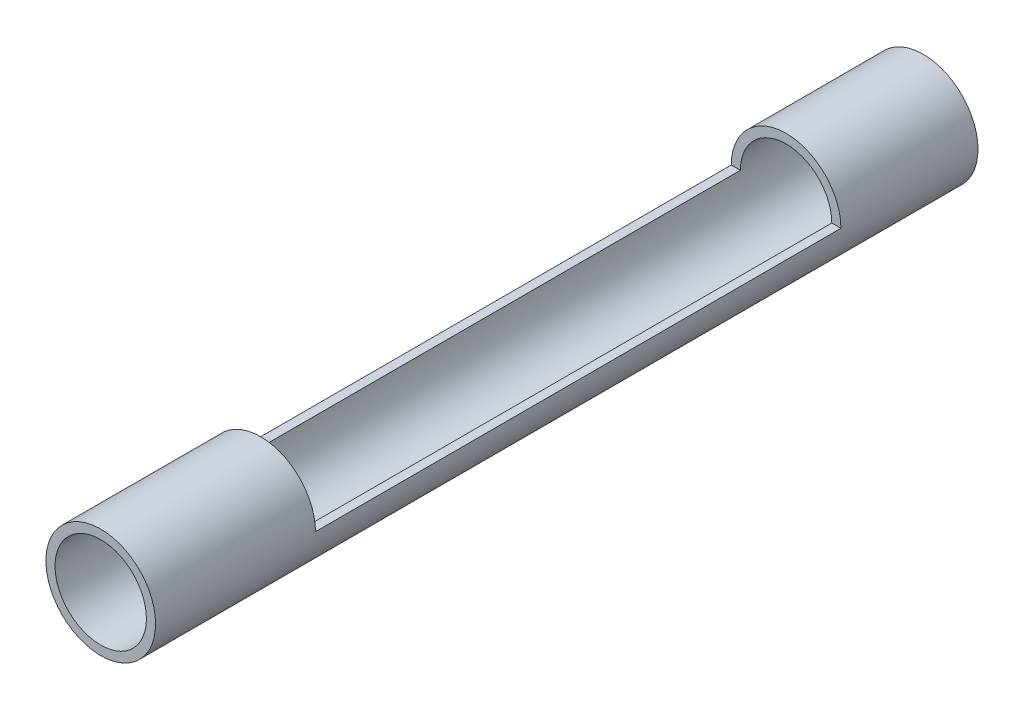
ISO-10303-21;
HEADER;
FILE_DESCRIPTION(('STEP AP214'),'2;1');
FILE_NAME('part.step','',(''),(''),'','','');
FILE_SCHEMA(('AUTOMOTIVE_DESIGN { 1 0 10303 214 1 1 1 1 }'));
ENDSEC;
DATA;
#1=APPLICATION_CONTEXT('core data for automotive mechanical design processes');
#2=APPLICATION_PROTOCOL_DEFINITION('international standard','automotive_design',2000,#1);
#3=PRODUCT_CONTEXT('',#1,'mechanical');
#4=PRODUCT('Part','Part','',(#3));
#5=PRODUCT_RELATED_PRODUCT_CATEGORY('part','',(#4));
#6=PRODUCT_DEFINITION_FORMATION('','',#4);
#7=PRODUCT_DEFINITION_CONTEXT('part definition',#1,'design');
#8=PRODUCT_DEFINITION('design','',#6,#7);
#9=PRODUCT_DEFINITION_SHAPE('','',#8);
#10=(LENGTH_UNIT() NAMED_UNIT(*) SI_UNIT(.MILLI.,.METRE.));
#11=(NAMED_UNIT(*) PLANE_ANGLE_UNIT() SI_UNIT($,.RADIAN.));
#12=(NAMED_UNIT(*) SI_UNIT($,.STERADIAN.) SOLID_ANGLE_UNIT());
#13=UNCERTAINTY_MEASURE_WITH_UNIT(LENGTH_MEASURE(1.E-05),#10,'distance_accuracy_value','');
#14=(GEOMETRIC_REPRESENTATION_CONTEXT(3) GLOBAL_UNCERTAINTY_ASSIGNED_CONTEXT((#13)) GLOBAL_UNIT_ASSIGNED_CONTEXT((#10,
#11,#12)) REPRESENTATION_CONTEXT('',''));
#15=CARTESIAN_POINT('',(0.,0.,0.));
#16=DIRECTION('',(0.,0.,1.));
#17=DIRECTION('',(1.,0.,0.));
#18=AXIS2_PLACEMENT_3D('',#15,#16,#17);
#19=CARTESIAN_POINT('',(0.,0.,180.));
#20=DIRECTION('',(0.,0.,-1.));
#21=DIRECTION('',(-1.,0.,0.));
#22=AXIS2_PLACEMENT_3D('',#19,#20,#21);
#23=CYLINDRICAL_SURFACE('',#22,12.);
#24=CARTESIAN_POINT('',(0.,0.,180.));
#25=DIRECTION('',(0.,0.,1.));
#26=DIRECTION('',(1.,0.,0.));
#27=AXIS2_PLACEMENT_3D('',#24,#25,#26);
#28=CIRCLE('',#27,12.);
#29=CARTESIAN_POINT('',(12.,0.,180.));
#30=VERTEX_POINT('',#29);
#31=EDGE_CURVE('E104',#30,#30,#28,.T.);
#32=ORIENTED_EDGE('',*,*,#31,.F.);
#33=EDGE_LOOP('',(#32));
#34=FACE_BOUND('',#33,.T.);
#35=CARTESIAN_POINT('',(0.,0.,0.));
#36=DIRECTION('',(0.,0.,1.));
#37=DIRECTION('',(1.,0.,0.));
#38=AXIS2_PLACEMENT_3D('',#35,#36,#37);
#39=CIRCLE('',#38,12.);
#40=CARTESIAN_POINT('',(12.,0.,0.));
#41=VERTEX_POINT('',#40);
#42=EDGE_CURVE('E101',#41,#41,#39,.T.);
#43=ORIENTED_EDGE('',*,*,#42,.T.);
#44=EDGE_LOOP('',(#43));
#45=FACE_BOUND('',#44,.T.);
#46=CARTESIAN_POINT('',(0.,0.,30.));
#47=DIRECTION('',(0.,0.,1.));
#48=DIRECTION('',(1.,0.,0.));
#49=AXIS2_PLACEMENT_3D('',#46,#47,#48);
#50=CIRCLE('',#49,12.);
#51=CARTESIAN_POINT('',(12.,0.,30.));
#52=VERTEX_POINT('',#51);
#53=CARTESIAN_POINT('',(-12.,0.,30.));
#54=VERTEX_POINT('',#53);
#55=EDGE_CURVE('E87',#52,#54,#50,.T.);
#56=ORIENTED_EDGE('',*,*,#55,.F.);
#57=DIRECTION('',(0.,0.,-1.));
#58=VECTOR('',#57,1.);
#59=CARTESIAN_POINT('',(12.,0.,180.));
#60=LINE('',#59,#58);
#61=CARTESIAN_POINT('',(12.,0.,145.));
#62=VERTEX_POINT('',#61);
#63=EDGE_CURVE('E74',#62,#52,#60,.T.);
#64=ORIENTED_EDGE('',*,*,#63,.F.);
#65=CARTESIAN_POINT('',(0.,0.,145.));
#66=DIRECTION('',(0.,0.,-1.));
#67=DIRECTION('',(-1.,0.,0.));
#68=AXIS2_PLACEMENT_3D('',#65,#66,#67);
#69=CIRCLE('',#68,12.);
#70=CARTESIAN_POINT('',(-12.,0.,145.));
#71=VERTEX_POINT('',#70);
#72=EDGE_CURVE('E84',#71,#62,#69,.T.);
#73=ORIENTED_EDGE('',*,*,#72,.F.);
#74=DIRECTION('',(0.,0.,-1.));
#75=VECTOR('',#74,1.);
#76=CARTESIAN_POINT('',(-12.,0.,180.));
#77=LINE('',#76,#75);
#78=EDGE_CURVE('E53',#54,#71,#77,.F.);
#79=ORIENTED_EDGE('',*,*,#78,.F.);
#80=EDGE_LOOP('',(#56,#64,#73,#79));
#81=FACE_BOUND('',#80,.T.);
#82=ADVANCED_FACE('F32',(#34,#45,#81),#23,.T.);
#83=CARTESIAN_POINT('',(0.,0.,180.));
#84=DIRECTION('',(0.,0.,-1.));
#85=DIRECTION('',(-1.,0.,0.));
#86=AXIS2_PLACEMENT_3D('',#83,#84,#85);
#87=CYLINDRICAL_SURFACE('',#86,10.);
#88=CARTESIAN_POINT('',(0.,0.,0.));
#89=DIRECTION('',(0.,0.,1.));
#90=DIRECTION('',(1.,0.,0.));
#91=AXIS2_PLACEMENT_3D('',#88,#89,#90);
#92=CIRCLE('',#91,10.);
#93=CARTESIAN_POINT('',(10.,0.,0.));
#94=VERTEX_POINT('',#93);
#95=EDGE_CURVE('E97',#94,#94,#92,.T.);
#96=ORIENTED_EDGE('',*,*,#95,.F.);
#97=EDGE_LOOP('',(#96));
#98=FACE_BOUND('',#97,.T.);
#99=CARTESIAN_POINT('',(0.,0.,180.));
#100=DIRECTION('',(0.,0.,1.));
#101=DIRECTION('',(1.,0.,0.));
#102=AXIS2_PLACEMENT_3D('',#99,#100,#101);
#103=CIRCLE('',#102,10.);
#104=CARTESIAN_POINT('',(10.,0.,180.));
#105=VERTEX_POINT('',#104);
#106=EDGE_CURVE('E98',#105,#105,#103,.T.);
#107=ORIENTED_EDGE('',*,*,#106,.T.);
#108=EDGE_LOOP('',(#107));
#109=FACE_BOUND('',#108,.T.);
#110=DIRECTION('',(0.,0.,-1.));
#111=VECTOR('',#110,1.);
#112=CARTESIAN_POINT('',(-10.,0.,180.));
#113=LINE('',#112,#111);
#114=CARTESIAN_POINT('',(-10.,0.,30.));
#115=VERTEX_POINT('',#114);
#116=CARTESIAN_POINT('',(-10.,0.,145.));
#117=VERTEX_POINT('',#116);
#118=EDGE_CURVE('E110',#115,#117,#113,.F.);
#119=ORIENTED_EDGE('',*,*,#118,.T.);
#120=CARTESIAN_POINT('',(0.,0.,145.));
#121=DIRECTION('',(0.,0.,-1.));
#122=DIRECTION('',(-1.,0.,0.));
#123=AXIS2_PLACEMENT_3D('',#120,#121,#122);
#124=CIRCLE('',#123,10.);
#125=CARTESIAN_POINT('',(10.,0.,145.));
#126=VERTEX_POINT('',#125);
#127=EDGE_CURVE('E11',#117,#126,#124,.T.);
#128=ORIENTED_EDGE('',*,*,#127,.T.);
#129=DIRECTION('',(0.,0.,-1.));
#130=VECTOR('',#129,1.);
#131=CARTESIAN_POINT('',(10.,0.,180.));
#132=LINE('',#131,#130);
#133=CARTESIAN_POINT('',(10.,0.,30.));
#134=VERTEX_POINT('',#133);
#135=EDGE_CURVE('E39',#126,#134,#132,.T.);
#136=ORIENTED_EDGE('',*,*,#135,.T.);
#137=CARTESIAN_POINT('',(0.,0.,30.));
#138=DIRECTION('',(0.,0.,1.));
#139=DIRECTION('',(1.,0.,0.));
#140=AXIS2_PLACEMENT_3D('',#137,#138,#139);
#141=CIRCLE('',#140,10.);
#142=EDGE_CURVE('E89',#134,#115,#141,.T.);
#143=ORIENTED_EDGE('',*,*,#142,.T.);
#144=EDGE_LOOP('',(#119,#128,#136,#143));
#145=FACE_BOUND('',#144,.T.);
#146=ADVANCED_FACE('F113',(#98,#109,#145),#87,.F.);
#147=CARTESIAN_POINT('',(0.,0.,180.));
#148=DIRECTION('',(0.,0.,1.));
#149=DIRECTION('',(1.,0.,0.));
#150=AXIS2_PLACEMENT_3D('',#147,#148,#149);
#151=PLANE('',#150);
#152=ORIENTED_EDGE('',*,*,#31,.T.);
#153=EDGE_LOOP('',(#152));
#154=FACE_BOUND('',#153,.T.);
#155=ORIENTED_EDGE('',*,*,#106,.F.);
#156=EDGE_LOOP('',(#155));
#157=FACE_BOUND('',#156,.T.);
#158=ADVANCED_FACE('F130',(#154,#157),#151,.T.);
#159=CARTESIAN_POINT('',(0.,0.,0.));
#160=DIRECTION('',(0.,0.,1.));
#161=DIRECTION('',(1.,0.,0.));
#162=AXIS2_PLACEMENT_3D('',#159,#160,#161);
#163=PLANE('',#162);
#164=ORIENTED_EDGE('',*,*,#42,.F.);
#165=EDGE_LOOP('',(#164));
#166=FACE_BOUND('',#165,.T.);
#167=ORIENTED_EDGE('',*,*,#95,.T.);
#168=EDGE_LOOP('',(#167));
#169=FACE_BOUND('',#168,.T.);
#170=ADVANCED_FACE('F137',(#166,#169),#163,.F.);
#171=CARTESIAN_POINT('',(20.,12.,145.));
#172=DIRECTION('',(0.,0.,-1.));
#173=DIRECTION('',(-1.,0.,0.));
#174=AXIS2_PLACEMENT_3D('',#171,#172,#173);
#175=PLANE('',#174);
#176=ORIENTED_EDGE('',*,*,#72,.T.);
#177=DIRECTION('',(-1.,0.,0.));
#178=VECTOR('',#177,1.);
#179=CARTESIAN_POINT('',(20.,0.,145.));
#180=LINE('',#179,#178);
#181=EDGE_CURVE('E80',#62,#126,#180,.T.);
#182=ORIENTED_EDGE('',*,*,#181,.T.);
#183=ORIENTED_EDGE('',*,*,#127,.F.);
#184=EDGE_CURVE('E90',#117,#71,#180,.T.);
#185=ORIENTED_EDGE('',*,*,#184,.T.);
#186=EDGE_LOOP('',(#176,#182,#183,#185));
#187=FACE_BOUND('',#186,.T.);
#188=ADVANCED_FACE('F115',(#187),#175,.T.);
#189=CARTESIAN_POINT('',(20.,0.,145.));
#190=DIRECTION('',(0.,1.,0.));
#191=DIRECTION('',(0.,0.,1.));
#192=AXIS2_PLACEMENT_3D('',#189,#190,#191);
#193=PLANE('',#192);
#194=ORIENTED_EDGE('',*,*,#63,.T.);
#195=DIRECTION('',(-1.,0.,0.));
#196=VECTOR('',#195,1.);
#197=CARTESIAN_POINT('',(20.,0.,30.));
#198=LINE('',#197,#196);
#199=EDGE_CURVE('E77',#52,#134,#198,.T.);
#200=ORIENTED_EDGE('',*,*,#199,.T.);
#201=ORIENTED_EDGE('',*,*,#135,.F.);
#202=ORIENTED_EDGE('',*,*,#181,.F.);
#203=EDGE_LOOP('',(#194,#200,#201,#202));
#204=FACE_BOUND('',#203,.T.);
#205=ADVANCED_FACE('F76',(#204),#193,.T.);
#206=ORIENTED_EDGE('',*,*,#78,.T.);
#207=ORIENTED_EDGE('',*,*,#184,.F.);
#208=ORIENTED_EDGE('',*,*,#118,.F.);
#209=EDGE_CURVE('E46',#115,#54,#198,.T.);
#210=ORIENTED_EDGE('',*,*,#209,.T.);
#211=EDGE_LOOP('',(#206,#207,#208,#210));
#212=FACE_BOUND('',#211,.T.);
#213=ADVANCED_FACE('F116',(#212),#193,.T.);
#214=CARTESIAN_POINT('',(20.,12.,30.));
#215=DIRECTION('',(0.,0.,1.));
#216=DIRECTION('',(1.,0.,0.));
#217=AXIS2_PLACEMENT_3D('',#214,#215,#216);
#218=PLANE('',#217);
#219=ORIENTED_EDGE('',*,*,#55,.T.);
#220=ORIENTED_EDGE('',*,*,#209,.F.);
#221=ORIENTED_EDGE('',*,*,#142,.F.);
#222=ORIENTED_EDGE('',*,*,#199,.F.);
#223=EDGE_LOOP('',(#219,#220,#221,#222));
#224=FACE_BOUND('',#223,.T.);
#225=ADVANCED_FACE('F86',(#224),#218,.T.);
#226=CLOSED_SHELL('',(#82,#146,#158,#170,#188,#205,#213,#225));
#227=MANIFOLD_SOLID_BREP('B2',#226);
#228=ADVANCED_BREP_SHAPE_REPRESENTATION('',(#18,#227),#14);
#229=SHAPE_DEFINITION_REPRESENTATION(#9,#228);
ENDSEC;
END-ISO-10303-21;
